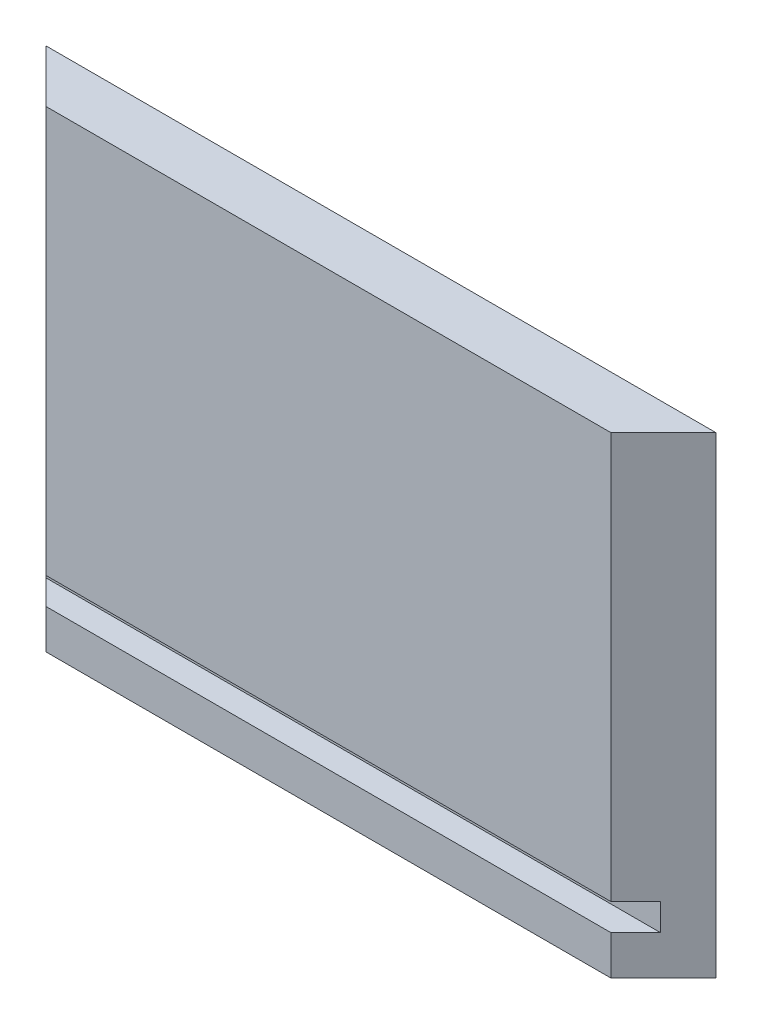
ISO-10303-21;
HEADER;
FILE_DESCRIPTION(('STEP AP214'),'2;1');
FILE_NAME('part.step','',(''),(''),'','','');
FILE_SCHEMA(('AUTOMOTIVE_DESIGN { 1 0 10303 214 1 1 1 1 }'));
ENDSEC;
DATA;
#1=APPLICATION_CONTEXT('core data for automotive mechanical design processes');
#2=APPLICATION_PROTOCOL_DEFINITION('international standard','automotive_design',2000,#1);
#3=PRODUCT_CONTEXT('',#1,'mechanical');
#4=PRODUCT('Part','Part','',(#3));
#5=PRODUCT_RELATED_PRODUCT_CATEGORY('part','',(#4));
#6=PRODUCT_DEFINITION_FORMATION('','',#4);
#7=PRODUCT_DEFINITION_CONTEXT('part definition',#1,'design');
#8=PRODUCT_DEFINITION('design','',#6,#7);
#9=PRODUCT_DEFINITION_SHAPE('','',#8);
#10=(LENGTH_UNIT() NAMED_UNIT(*) SI_UNIT(.MILLI.,.METRE.));
#11=(NAMED_UNIT(*) PLANE_ANGLE_UNIT() SI_UNIT($,.RADIAN.));
#12=(NAMED_UNIT(*) SI_UNIT($,.STERADIAN.) SOLID_ANGLE_UNIT());
#13=UNCERTAINTY_MEASURE_WITH_UNIT(LENGTH_MEASURE(1.E-05),#10,'distance_accuracy_value','');
#14=(GEOMETRIC_REPRESENTATION_CONTEXT(3) GLOBAL_UNCERTAINTY_ASSIGNED_CONTEXT((#13)) GLOBAL_UNIT_ASSIGNED_CONTEXT((#10,
#11,#12)) REPRESENTATION_CONTEXT('',''));
#15=CARTESIAN_POINT('',(0.,0.,0.));
#16=DIRECTION('',(0.,0.,1.));
#17=DIRECTION('',(1.,0.,0.));
#18=AXIS2_PLACEMENT_3D('',#15,#16,#17);
#19=CARTESIAN_POINT('',(74.6506,57.15,6.35));
#20=DIRECTION('',(0.,0.,-1.));
#21=DIRECTION('',(-1.,0.,0.));
#22=AXIS2_PLACEMENT_3D('',#19,#20,#21);
#23=PLANE('',#22);
#24=DIRECTION('',(0.,-1.,0.));
#25=VECTOR('',#24,1.);
#26=CARTESIAN_POINT('',(6.34999999999999,57.15,6.35000000000001));
#27=LINE('',#26,#25);
#28=CARTESIAN_POINT('',(6.34999999999999,57.15,6.35000000000001));
#29=VERTEX_POINT('',#28);
#30=CARTESIAN_POINT('',(6.34999999999999,8.0137,6.35));
#31=VERTEX_POINT('',#30);
#32=EDGE_CURVE('E163',#29,#31,#27,.T.);
#33=ORIENTED_EDGE('',*,*,#32,.T.);
#34=DIRECTION('',(1.,0.,0.));
#35=VECTOR('',#34,1.);
#36=CARTESIAN_POINT('',(-1.2E-05,8.0137,6.35));
#37=LINE('',#36,#35);
#38=CARTESIAN_POINT('',(74.6506,8.01369999999999,6.35));
#39=VERTEX_POINT('',#38);
#40=EDGE_CURVE('E134',#31,#39,#37,.T.);
#41=ORIENTED_EDGE('',*,*,#40,.T.);
#42=DIRECTION('',(0.,-1.,0.));
#43=VECTOR('',#42,1.);
#44=CARTESIAN_POINT('',(74.6506,57.15,6.35));
#45=LINE('',#44,#43);
#46=CARTESIAN_POINT('',(74.6506,57.15,6.35));
#47=VERTEX_POINT('',#46);
#48=EDGE_CURVE('E160',#47,#39,#45,.T.);
#49=ORIENTED_EDGE('',*,*,#48,.F.);
#50=DIRECTION('',(1.,0.,0.));
#51=VECTOR('',#50,1.);
#52=CARTESIAN_POINT('',(74.6506,57.15,6.35));
#53=LINE('',#52,#51);
#54=EDGE_CURVE('E92',#29,#47,#53,.T.);
#55=ORIENTED_EDGE('',*,*,#54,.F.);
#56=EDGE_LOOP('',(#33,#41,#49,#55));
#57=FACE_BOUND('',#56,.T.);
#58=ADVANCED_FACE('F39',(#57),#23,.F.);
#59=CARTESIAN_POINT('',(6.34999999999999,57.15,6.35000000000001));
#60=DIRECTION('',(0.707106781186549,0.,-0.707106781186547));
#61=DIRECTION('',(-0.707106781186547,0.,-0.707106781186549));
#62=AXIS2_PLACEMENT_3D('',#59,#60,#61);
#63=PLANE('',#62);
#64=DIRECTION('',(0.,1.,0.));
#65=VECTOR('',#64,1.);
#66=CARTESIAN_POINT('',(3.35279999999999,57.15,3.3528));
#67=LINE('',#66,#65);
#68=CARTESIAN_POINT('',(3.35279999999999,4.7625,3.3528));
#69=VERTEX_POINT('',#68);
#70=CARTESIAN_POINT('',(3.35279999999999,8.0137,3.3528));
#71=VERTEX_POINT('',#70);
#72=EDGE_CURVE('E115',#69,#71,#67,.T.);
#73=ORIENTED_EDGE('',*,*,#72,.T.);
#74=DIRECTION('',(0.707106781186547,0.,0.707106781186549));
#75=VECTOR('',#74,1.);
#76=CARTESIAN_POINT('',(6.34999999999999,8.0137,6.35000000000001));
#77=LINE('',#76,#75);
#78=EDGE_CURVE('E125',#71,#31,#77,.T.);
#79=ORIENTED_EDGE('',*,*,#78,.T.);
#80=ORIENTED_EDGE('',*,*,#32,.F.);
#81=DIRECTION('',(0.707106781186546,0.,0.707106781186549));
#82=VECTOR('',#81,1.);
#83=CARTESIAN_POINT('',(6.34999999999999,57.15,6.35000000000001));
#84=LINE('',#83,#82);
#85=CARTESIAN_POINT('',(0.,57.15,0.));
#86=VERTEX_POINT('',#85);
#87=EDGE_CURVE('E142',#86,#29,#84,.T.);
#88=ORIENTED_EDGE('',*,*,#87,.F.);
#89=DIRECTION('',(0.,-1.,0.));
#90=VECTOR('',#89,1.);
#91=CARTESIAN_POINT('',(0.,57.15,0.));
#92=LINE('',#91,#90);
#93=CARTESIAN_POINT('',(0.,0.,0.));
#94=VERTEX_POINT('',#93);
#95=EDGE_CURVE('E148',#86,#94,#92,.T.);
#96=ORIENTED_EDGE('',*,*,#95,.T.);
#97=DIRECTION('',(0.707106781186546,0.,0.707106781186549));
#98=VECTOR('',#97,1.);
#99=CARTESIAN_POINT('',(6.34999999999999,0.,6.35000000000001));
#100=LINE('',#99,#98);
#101=CARTESIAN_POINT('',(6.34999999999999,0.,6.35000000000001));
#102=VERTEX_POINT('',#101);
#103=EDGE_CURVE('E141',#94,#102,#100,.T.);
#104=ORIENTED_EDGE('',*,*,#103,.T.);
#105=CARTESIAN_POINT('',(6.34999999999999,4.7625,6.35));
#106=VERTEX_POINT('',#105);
#107=EDGE_CURVE('E133',#106,#102,#27,.T.);
#108=ORIENTED_EDGE('',*,*,#107,.F.);
#109=DIRECTION('',(-0.707106781186547,0.,-0.707106781186549));
#110=VECTOR('',#109,1.);
#111=CARTESIAN_POINT('',(6.35000000000001,4.7625,6.35000000000003));
#112=LINE('',#111,#110);
#113=EDGE_CURVE('E126',#106,#69,#112,.T.);
#114=ORIENTED_EDGE('',*,*,#113,.T.);
#115=EDGE_LOOP('',(#73,#79,#80,#88,#96,#104,#108,#114));
#116=FACE_BOUND('',#115,.T.);
#117=ADVANCED_FACE('F41',(#116),#63,.F.);
#118=CARTESIAN_POINT('',(74.6506,4.7625,6.35));
#119=VERTEX_POINT('',#118);
#120=CARTESIAN_POINT('',(74.6506,0.,6.35));
#121=VERTEX_POINT('',#120);
#122=EDGE_CURVE('E159',#119,#121,#45,.T.);
#123=ORIENTED_EDGE('',*,*,#122,.F.);
#124=DIRECTION('',(1.,0.,0.));
#125=VECTOR('',#124,1.);
#126=CARTESIAN_POINT('',(-1.2E-05,4.7625,6.35));
#127=LINE('',#126,#125);
#128=EDGE_CURVE('E54',#106,#119,#127,.T.);
#129=ORIENTED_EDGE('',*,*,#128,.F.);
#130=ORIENTED_EDGE('',*,*,#107,.T.);
#131=DIRECTION('',(1.,0.,0.));
#132=VECTOR('',#131,1.);
#133=CARTESIAN_POINT('',(74.6506,0.,6.35));
#134=LINE('',#133,#132);
#135=EDGE_CURVE('E150',#102,#121,#134,.T.);
#136=ORIENTED_EDGE('',*,*,#135,.T.);
#137=EDGE_LOOP('',(#123,#129,#130,#136));
#138=FACE_BOUND('',#137,.T.);
#139=ADVANCED_FACE('F182',(#138),#23,.F.);
#140=CARTESIAN_POINT('',(81.0006,57.15,0.));
#141=DIRECTION('',(-0.707106781186549,0.,-0.707106781186546));
#142=DIRECTION('',(-0.707106781186546,0.,0.707106781186549));
#143=AXIS2_PLACEMENT_3D('',#140,#141,#142);
#144=PLANE('',#143);
#145=ORIENTED_EDGE('',*,*,#48,.T.);
#146=DIRECTION('',(0.707106781186546,0.,-0.707106781186549));
#147=VECTOR('',#146,1.);
#148=CARTESIAN_POINT('',(81.0006,8.01369999999999,0.));
#149=LINE('',#148,#147);
#150=CARTESIAN_POINT('',(77.6478,8.0137,3.3528));
#151=VERTEX_POINT('',#150);
#152=EDGE_CURVE('E11',#39,#151,#149,.T.);
#153=ORIENTED_EDGE('',*,*,#152,.T.);
#154=DIRECTION('',(0.,-1.,0.));
#155=VECTOR('',#154,1.);
#156=CARTESIAN_POINT('',(77.6478,57.15,3.3528));
#157=LINE('',#156,#155);
#158=CARTESIAN_POINT('',(77.6478,4.7625,3.3528));
#159=VERTEX_POINT('',#158);
#160=EDGE_CURVE('E47',#151,#159,#157,.T.);
#161=ORIENTED_EDGE('',*,*,#160,.T.);
#162=DIRECTION('',(-0.707106781186546,0.,0.707106781186549));
#163=VECTOR('',#162,1.);
#164=CARTESIAN_POINT('',(81.0006,4.76249999999999,0.));
#165=LINE('',#164,#163);
#166=EDGE_CURVE('E129',#159,#119,#165,.T.);
#167=ORIENTED_EDGE('',*,*,#166,.T.);
#168=ORIENTED_EDGE('',*,*,#122,.T.);
#169=DIRECTION('',(0.707106781186546,0.,-0.707106781186549));
#170=VECTOR('',#169,1.);
#171=CARTESIAN_POINT('',(81.0006,0.,0.));
#172=LINE('',#171,#170);
#173=CARTESIAN_POINT('',(81.0006,0.,0.));
#174=VERTEX_POINT('',#173);
#175=EDGE_CURVE('E153',#121,#174,#172,.T.);
#176=ORIENTED_EDGE('',*,*,#175,.T.);
#177=DIRECTION('',(0.,-1.,0.));
#178=VECTOR('',#177,1.);
#179=CARTESIAN_POINT('',(81.0006,57.15,0.));
#180=LINE('',#179,#178);
#181=CARTESIAN_POINT('',(81.0006,57.15,0.));
#182=VERTEX_POINT('',#181);
#183=EDGE_CURVE('E157',#182,#174,#180,.T.);
#184=ORIENTED_EDGE('',*,*,#183,.F.);
#185=DIRECTION('',(0.707106781186546,0.,-0.707106781186549));
#186=VECTOR('',#185,1.);
#187=CARTESIAN_POINT('',(81.0006,57.15,0.));
#188=LINE('',#187,#186);
#189=EDGE_CURVE('E145',#47,#182,#188,.T.);
#190=ORIENTED_EDGE('',*,*,#189,.F.);
#191=EDGE_LOOP('',(#145,#153,#161,#167,#168,#176,#184,#190));
#192=FACE_BOUND('',#191,.T.);
#193=ADVANCED_FACE('F166',(#192),#144,.F.);
#194=CARTESIAN_POINT('',(0.,57.15,0.));
#195=DIRECTION('',(0.,0.,1.));
#196=DIRECTION('',(1.,0.,0.));
#197=AXIS2_PLACEMENT_3D('',#194,#195,#196);
#198=PLANE('',#197);
#199=DIRECTION('',(-1.,0.,0.));
#200=VECTOR('',#199,1.);
#201=CARTESIAN_POINT('',(0.,0.,0.));
#202=LINE('',#201,#200);
#203=EDGE_CURVE('E84',#174,#94,#202,.T.);
#204=ORIENTED_EDGE('',*,*,#203,.T.);
#205=ORIENTED_EDGE('',*,*,#95,.F.);
#206=DIRECTION('',(-1.,0.,0.));
#207=VECTOR('',#206,1.);
#208=CARTESIAN_POINT('',(0.,57.15,0.));
#209=LINE('',#208,#207);
#210=EDGE_CURVE('E63',#182,#86,#209,.T.);
#211=ORIENTED_EDGE('',*,*,#210,.F.);
#212=ORIENTED_EDGE('',*,*,#183,.T.);
#213=EDGE_LOOP('',(#204,#205,#211,#212));
#214=FACE_BOUND('',#213,.T.);
#215=ADVANCED_FACE('F183',(#214),#198,.F.);
#216=CARTESIAN_POINT('',(0.,57.15,0.));
#217=DIRECTION('',(0.,1.,0.));
#218=DIRECTION('',(0.,0.,1.));
#219=AXIS2_PLACEMENT_3D('',#216,#217,#218);
#220=PLANE('',#219);
#221=ORIENTED_EDGE('',*,*,#87,.T.);
#222=ORIENTED_EDGE('',*,*,#54,.T.);
#223=ORIENTED_EDGE('',*,*,#189,.T.);
#224=ORIENTED_EDGE('',*,*,#210,.T.);
#225=EDGE_LOOP('',(#221,#222,#223,#224));
#226=FACE_BOUND('',#225,.T.);
#227=ADVANCED_FACE('F175',(#226),#220,.T.);
#228=CARTESIAN_POINT('',(0.,0.,0.));
#229=DIRECTION('',(0.,1.,0.));
#230=DIRECTION('',(0.,0.,1.));
#231=AXIS2_PLACEMENT_3D('',#228,#229,#230);
#232=PLANE('',#231);
#233=ORIENTED_EDGE('',*,*,#103,.F.);
#234=ORIENTED_EDGE('',*,*,#203,.F.);
#235=ORIENTED_EDGE('',*,*,#175,.F.);
#236=ORIENTED_EDGE('',*,*,#135,.F.);
#237=EDGE_LOOP('',(#233,#234,#235,#236));
#238=FACE_BOUND('',#237,.T.);
#239=ADVANCED_FACE('F179',(#238),#232,.F.);
#240=CARTESIAN_POINT('',(-1.2E-05,8.0137,3.3528));
#241=DIRECTION('',(0.,1.,0.));
#242=DIRECTION('',(0.,0.,1.));
#243=AXIS2_PLACEMENT_3D('',#240,#241,#242);
#244=PLANE('',#243);
#245=DIRECTION('',(1.,0.,0.));
#246=VECTOR('',#245,1.);
#247=CARTESIAN_POINT('',(-1.2E-05,8.0137,3.3528));
#248=LINE('',#247,#246);
#249=EDGE_CURVE('E121',#71,#151,#248,.T.);
#250=ORIENTED_EDGE('',*,*,#249,.T.);
#251=ORIENTED_EDGE('',*,*,#152,.F.);
#252=ORIENTED_EDGE('',*,*,#40,.F.);
#253=ORIENTED_EDGE('',*,*,#78,.F.);
#254=EDGE_LOOP('',(#250,#251,#252,#253));
#255=FACE_BOUND('',#254,.T.);
#256=ADVANCED_FACE('F169',(#255),#244,.F.);
#257=CARTESIAN_POINT('',(-1.2E-05,4.7625,3.3528));
#258=DIRECTION('',(0.,0.,-1.));
#259=DIRECTION('',(-1.,0.,0.));
#260=AXIS2_PLACEMENT_3D('',#257,#258,#259);
#261=PLANE('',#260);
#262=DIRECTION('',(1.,0.,0.));
#263=VECTOR('',#262,1.);
#264=CARTESIAN_POINT('',(-1.2E-05,4.7625,3.3528));
#265=LINE('',#264,#263);
#266=EDGE_CURVE('E118',#69,#159,#265,.T.);
#267=ORIENTED_EDGE('',*,*,#266,.T.);
#268=ORIENTED_EDGE('',*,*,#160,.F.);
#269=ORIENTED_EDGE('',*,*,#249,.F.);
#270=ORIENTED_EDGE('',*,*,#72,.F.);
#271=EDGE_LOOP('',(#267,#268,#269,#270));
#272=FACE_BOUND('',#271,.T.);
#273=ADVANCED_FACE('F117',(#272),#261,.F.);
#274=CARTESIAN_POINT('',(-1.2E-05,4.7625,6.35));
#275=DIRECTION('',(0.,-1.,0.));
#276=DIRECTION('',(0.,0.,-1.));
#277=AXIS2_PLACEMENT_3D('',#274,#275,#276);
#278=PLANE('',#277);
#279=ORIENTED_EDGE('',*,*,#128,.T.);
#280=ORIENTED_EDGE('',*,*,#166,.F.);
#281=ORIENTED_EDGE('',*,*,#266,.F.);
#282=ORIENTED_EDGE('',*,*,#113,.F.);
#283=EDGE_LOOP('',(#279,#280,#281,#282));
#284=FACE_BOUND('',#283,.T.);
#285=ADVANCED_FACE('F128',(#284),#278,.F.);
#286=CLOSED_SHELL('',(#58,#117,#139,#193,#215,#227,#239,#256,#273,#285));
#287=MANIFOLD_SOLID_BREP('B2',#286);
#288=ADVANCED_BREP_SHAPE_REPRESENTATION('',(#18,#287),#14);
#289=SHAPE_DEFINITION_REPRESENTATION(#9,#288);
ENDSEC;
END-ISO-10303-21;
